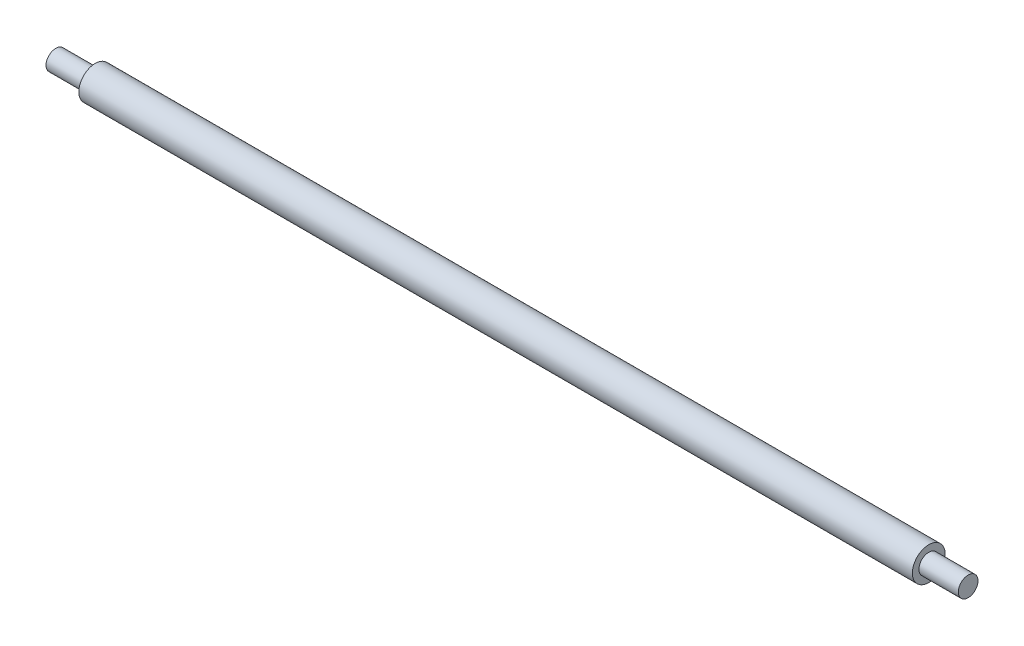
ISO-10303-21;
HEADER;
FILE_DESCRIPTION(('STEP AP214'),'2;1');
FILE_NAME('part.step','',(''),(''),'','','');
FILE_SCHEMA(('AUTOMOTIVE_DESIGN { 1 0 10303 214 1 1 1 1 }'));
ENDSEC;
DATA;
#1=APPLICATION_CONTEXT('core data for automotive mechanical design processes');
#2=APPLICATION_PROTOCOL_DEFINITION('international standard','automotive_design',2000,#1);
#3=PRODUCT_CONTEXT('',#1,'mechanical');
#4=PRODUCT('Part','Part','',(#3));
#5=PRODUCT_RELATED_PRODUCT_CATEGORY('part','',(#4));
#6=PRODUCT_DEFINITION_FORMATION('','',#4);
#7=PRODUCT_DEFINITION_CONTEXT('part definition',#1,'design');
#8=PRODUCT_DEFINITION('design','',#6,#7);
#9=PRODUCT_DEFINITION_SHAPE('','',#8);
#10=(LENGTH_UNIT() NAMED_UNIT(*) SI_UNIT(.MILLI.,.METRE.));
#11=(NAMED_UNIT(*) PLANE_ANGLE_UNIT() SI_UNIT($,.RADIAN.));
#12=(NAMED_UNIT(*) SI_UNIT($,.STERADIAN.) SOLID_ANGLE_UNIT());
#13=UNCERTAINTY_MEASURE_WITH_UNIT(LENGTH_MEASURE(1.E-05),#10,'distance_accuracy_value','');
#14=(GEOMETRIC_REPRESENTATION_CONTEXT(3) GLOBAL_UNCERTAINTY_ASSIGNED_CONTEXT((#13)) GLOBAL_UNIT_ASSIGNED_CONTEXT((#10,
#11,#12)) REPRESENTATION_CONTEXT('',''));
#15=CARTESIAN_POINT('',(0.,0.,0.));
#16=DIRECTION('',(0.,0.,1.));
#17=DIRECTION('',(1.,0.,0.));
#18=AXIS2_PLACEMENT_3D('',#15,#16,#17);
#19=CARTESIAN_POINT('',(-63.5,0.,0.));
#20=DIRECTION('',(1.,0.,0.));
#21=DIRECTION('',(0.,0.,-1.));
#22=AXIS2_PLACEMENT_3D('',#19,#20,#21);
#23=PLANE('',#22);
#24=CARTESIAN_POINT('',(-63.5,0.,0.));
#25=DIRECTION('',(1.,0.,0.));
#26=DIRECTION('',(0.,0.,-1.));
#27=AXIS2_PLACEMENT_3D('',#24,#25,#26);
#28=CIRCLE('',#27,2.5);
#29=CARTESIAN_POINT('',(-63.5,0.,-2.5));
#30=VERTEX_POINT('',#29);
#31=EDGE_CURVE('E43',#30,#30,#28,.T.);
#32=ORIENTED_EDGE('',*,*,#31,.F.);
#33=EDGE_LOOP('',(#32));
#34=FACE_BOUND('',#33,.T.);
#35=CARTESIAN_POINT('',(-63.5,0.,0.));
#36=DIRECTION('',(1.,0.,0.));
#37=DIRECTION('',(0.,0.,-1.));
#38=AXIS2_PLACEMENT_3D('',#35,#36,#37);
#39=CIRCLE('',#38,1.5);
#40=CARTESIAN_POINT('',(-63.5,0.,-1.5));
#41=VERTEX_POINT('',#40);
#42=EDGE_CURVE('E10',#41,#41,#39,.F.);
#43=ORIENTED_EDGE('',*,*,#42,.F.);
#44=EDGE_LOOP('',(#43));
#45=FACE_BOUND('',#44,.T.);
#46=ADVANCED_FACE('F32',(#34,#45),#23,.F.);
#47=CARTESIAN_POINT('',(63.5,0.,0.));
#48=DIRECTION('',(1.,0.,0.));
#49=DIRECTION('',(0.,0.,-1.));
#50=AXIS2_PLACEMENT_3D('',#47,#48,#49);
#51=PLANE('',#50);
#52=CARTESIAN_POINT('',(63.5,0.,0.));
#53=DIRECTION('',(1.,0.,0.));
#54=DIRECTION('',(0.,0.,-1.));
#55=AXIS2_PLACEMENT_3D('',#52,#53,#54);
#56=CIRCLE('',#55,2.5);
#57=CARTESIAN_POINT('',(63.5,0.,-2.5));
#58=VERTEX_POINT('',#57);
#59=EDGE_CURVE('E39',#58,#58,#56,.T.);
#60=ORIENTED_EDGE('',*,*,#59,.T.);
#61=EDGE_LOOP('',(#60));
#62=FACE_BOUND('',#61,.T.);
#63=CARTESIAN_POINT('',(63.5,0.,0.));
#64=DIRECTION('',(1.,0.,0.));
#65=DIRECTION('',(0.,0.,-1.));
#66=AXIS2_PLACEMENT_3D('',#63,#64,#65);
#67=CIRCLE('',#66,1.5);
#68=CARTESIAN_POINT('',(63.5,0.,-1.5));
#69=VERTEX_POINT('',#68);
#70=EDGE_CURVE('E50',#69,#69,#67,.T.);
#71=ORIENTED_EDGE('',*,*,#70,.F.);
#72=EDGE_LOOP('',(#71));
#73=FACE_BOUND('',#72,.T.);
#74=ADVANCED_FACE('F74',(#62,#73),#51,.T.);
#75=CARTESIAN_POINT('',(63.5,0.,0.));
#76=DIRECTION('',(-1.,0.,0.));
#77=DIRECTION('',(0.,0.,1.));
#78=AXIS2_PLACEMENT_3D('',#75,#76,#77);
#79=CYLINDRICAL_SURFACE('',#78,2.5);
#80=ORIENTED_EDGE('',*,*,#59,.F.);
#81=EDGE_LOOP('',(#80));
#82=FACE_BOUND('',#81,.T.);
#83=ORIENTED_EDGE('',*,*,#31,.T.);
#84=EDGE_LOOP('',(#83));
#85=FACE_BOUND('',#84,.T.);
#86=ADVANCED_FACE('F34',(#82,#85),#79,.T.);
#87=CARTESIAN_POINT('',(69.5,0.,0.));
#88=DIRECTION('',(-1.,0.,0.));
#89=DIRECTION('',(0.,0.,1.));
#90=AXIS2_PLACEMENT_3D('',#87,#88,#89);
#91=CYLINDRICAL_SURFACE('',#90,1.5);
#92=CARTESIAN_POINT('',(69.5,0.,0.));
#93=DIRECTION('',(1.,0.,0.));
#94=DIRECTION('',(0.,0.,-1.));
#95=AXIS2_PLACEMENT_3D('',#92,#93,#94);
#96=CIRCLE('',#95,1.5);
#97=CARTESIAN_POINT('',(69.5,0.,-1.5));
#98=VERTEX_POINT('',#97);
#99=EDGE_CURVE('E48',#98,#98,#96,.T.);
#100=ORIENTED_EDGE('',*,*,#99,.F.);
#101=EDGE_LOOP('',(#100));
#102=FACE_BOUND('',#101,.T.);
#103=ORIENTED_EDGE('',*,*,#70,.T.);
#104=EDGE_LOOP('',(#103));
#105=FACE_BOUND('',#104,.T.);
#106=ADVANCED_FACE('F70',(#102,#105),#91,.T.);
#107=CARTESIAN_POINT('',(69.5,0.,0.));
#108=DIRECTION('',(1.,0.,0.));
#109=DIRECTION('',(0.,0.,-1.));
#110=AXIS2_PLACEMENT_3D('',#107,#108,#109);
#111=PLANE('',#110);
#112=ORIENTED_EDGE('',*,*,#99,.T.);
#113=EDGE_LOOP('',(#112));
#114=FACE_BOUND('',#113,.T.);
#115=ADVANCED_FACE('F63',(#114),#111,.T.);
#116=CARTESIAN_POINT('',(-69.5,0.,0.));
#117=DIRECTION('',(1.,0.,0.));
#118=DIRECTION('',(0.,0.,-1.));
#119=AXIS2_PLACEMENT_3D('',#116,#117,#118);
#120=CYLINDRICAL_SURFACE('',#119,1.5);
#121=CARTESIAN_POINT('',(-69.5,0.,0.));
#122=DIRECTION('',(-1.,0.,0.));
#123=DIRECTION('',(0.,0.,1.));
#124=AXIS2_PLACEMENT_3D('',#121,#122,#123);
#125=CIRCLE('',#124,1.5);
#126=CARTESIAN_POINT('',(-69.5,0.,1.5));
#127=VERTEX_POINT('',#126);
#128=EDGE_CURVE('E53',#127,#127,#125,.T.);
#129=ORIENTED_EDGE('',*,*,#128,.F.);
#130=EDGE_LOOP('',(#129));
#131=FACE_BOUND('',#130,.T.);
#132=ORIENTED_EDGE('',*,*,#42,.T.);
#133=EDGE_LOOP('',(#132));
#134=FACE_BOUND('',#133,.T.);
#135=ADVANCED_FACE('F61',(#131,#134),#120,.T.);
#136=CARTESIAN_POINT('',(-69.5,0.,0.));
#137=DIRECTION('',(-1.,0.,0.));
#138=DIRECTION('',(0.,0.,1.));
#139=AXIS2_PLACEMENT_3D('',#136,#137,#138);
#140=PLANE('',#139);
#141=ORIENTED_EDGE('',*,*,#128,.T.);
#142=EDGE_LOOP('',(#141));
#143=FACE_BOUND('',#142,.T.);
#144=ADVANCED_FACE('F59',(#143),#140,.T.);
#145=CLOSED_SHELL('',(#46,#74,#86,#106,#115,#135,#144));
#146=MANIFOLD_SOLID_BREP('B2',#145);
#147=ADVANCED_BREP_SHAPE_REPRESENTATION('',(#18,#146),#14);
#148=SHAPE_DEFINITION_REPRESENTATION(#9,#147);
ENDSEC;
END-ISO-10303-21;
